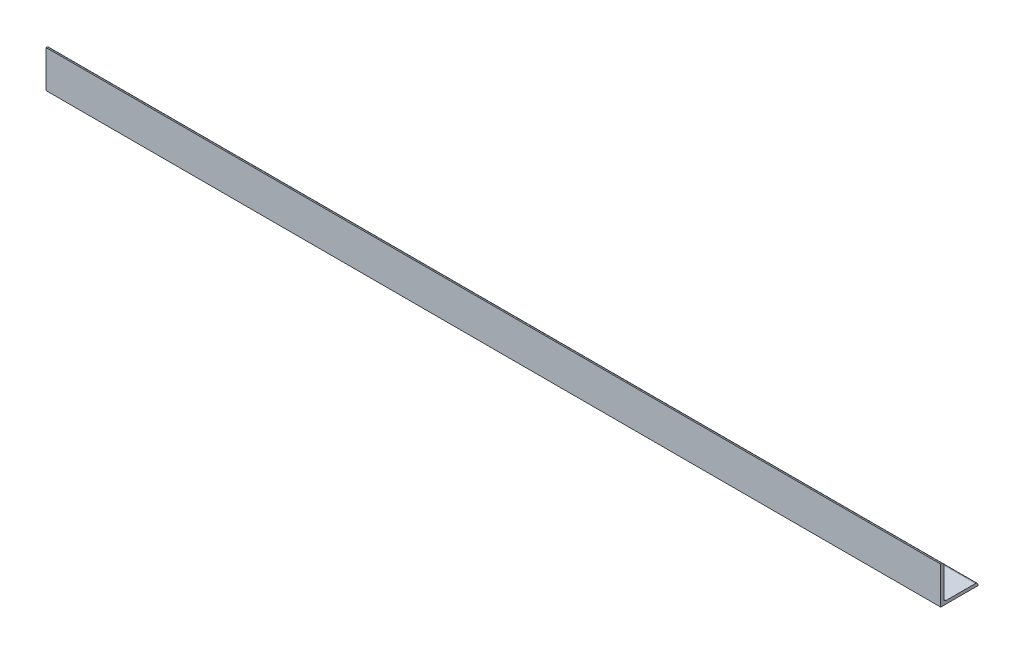
ISO-10303-21;
HEADER;
FILE_DESCRIPTION(('STEP AP214'),'2;1');
FILE_NAME('part.step','',(''),(''),'','','');
FILE_SCHEMA(('AUTOMOTIVE_DESIGN { 1 0 10303 214 1 1 1 1 }'));
ENDSEC;
DATA;
#1=APPLICATION_CONTEXT('core data for automotive mechanical design processes');
#2=APPLICATION_PROTOCOL_DEFINITION('international standard','automotive_design',2000,#1);
#3=PRODUCT_CONTEXT('',#1,'mechanical');
#4=PRODUCT('Part','Part','',(#3));
#5=PRODUCT_RELATED_PRODUCT_CATEGORY('part','',(#4));
#6=PRODUCT_DEFINITION_FORMATION('','',#4);
#7=PRODUCT_DEFINITION_CONTEXT('part definition',#1,'design');
#8=PRODUCT_DEFINITION('design','',#6,#7);
#9=PRODUCT_DEFINITION_SHAPE('','',#8);
#10=(LENGTH_UNIT() NAMED_UNIT(*) SI_UNIT(.MILLI.,.METRE.));
#11=(NAMED_UNIT(*) PLANE_ANGLE_UNIT() SI_UNIT($,.RADIAN.));
#12=(NAMED_UNIT(*) SI_UNIT($,.STERADIAN.) SOLID_ANGLE_UNIT());
#13=UNCERTAINTY_MEASURE_WITH_UNIT(LENGTH_MEASURE(1.E-05),#10,'distance_accuracy_value','');
#14=(GEOMETRIC_REPRESENTATION_CONTEXT(3) GLOBAL_UNCERTAINTY_ASSIGNED_CONTEXT((#13)) GLOBAL_UNIT_ASSIGNED_CONTEXT((#10,
#11,#12)) REPRESENTATION_CONTEXT('',''));
#15=CARTESIAN_POINT('',(0.,0.,0.));
#16=DIRECTION('',(0.,0.,1.));
#17=DIRECTION('',(1.,0.,0.));
#18=AXIS2_PLACEMENT_3D('',#15,#16,#17);
#19=CARTESIAN_POINT('',(-914.4,76.2,0.));
#20=DIRECTION('',(0.,1.,0.));
#21=DIRECTION('',(0.,0.,1.));
#22=AXIS2_PLACEMENT_3D('',#19,#20,#21);
#23=PLANE('',#22);
#24=DIRECTION('',(1.,0.,0.));
#25=VECTOR('',#24,1.);
#26=CARTESIAN_POINT('',(-914.4,76.2,0.));
#27=LINE('',#26,#25);
#28=CARTESIAN_POINT('',(-914.4,76.2,0.));
#29=VERTEX_POINT('',#28);
#30=CARTESIAN_POINT('',(914.4,76.2,0.));
#31=VERTEX_POINT('',#30);
#32=EDGE_CURVE('E35',#29,#31,#27,.T.);
#33=ORIENTED_EDGE('',*,*,#32,.T.);
#34=DIRECTION('',(0.,0.,1.));
#35=VECTOR('',#34,1.);
#36=CARTESIAN_POINT('',(914.4,76.2,0.));
#37=LINE('',#36,#35);
#38=CARTESIAN_POINT('',(914.4,76.2,-1.26999999999996));
#39=VERTEX_POINT('',#38);
#40=EDGE_CURVE('E102',#39,#31,#37,.T.);
#41=ORIENTED_EDGE('',*,*,#40,.F.);
#42=DIRECTION('',(1.,0.,0.));
#43=VECTOR('',#42,1.);
#44=CARTESIAN_POINT('',(-914.4,76.2,-1.26999999999996));
#45=LINE('',#44,#43);
#46=CARTESIAN_POINT('',(-914.4,76.2,-1.26999999999996));
#47=VERTEX_POINT('',#46);
#48=EDGE_CURVE('E11',#47,#39,#45,.T.);
#49=ORIENTED_EDGE('',*,*,#48,.F.);
#50=DIRECTION('',(0.,0.,1.));
#51=VECTOR('',#50,1.);
#52=CARTESIAN_POINT('',(-914.4,76.2,0.));
#53=LINE('',#52,#51);
#54=EDGE_CURVE('E103',#47,#29,#53,.T.);
#55=ORIENTED_EDGE('',*,*,#54,.T.);
#56=EDGE_LOOP('',(#33,#41,#49,#55));
#57=FACE_BOUND('',#56,.T.);
#58=ADVANCED_FACE('F32',(#57),#23,.T.);
#59=CARTESIAN_POINT('',(-914.4,71.12,-1.27));
#60=DIRECTION('',(1.,0.,0.));
#61=DIRECTION('',(0.,0.,-1.));
#62=AXIS2_PLACEMENT_3D('',#59,#60,#61);
#63=CYLINDRICAL_SURFACE('',#62,5.08);
#64=ORIENTED_EDGE('',*,*,#48,.T.);
#65=CARTESIAN_POINT('',(914.4,71.12,-1.27));
#66=DIRECTION('',(1.,0.,0.));
#67=DIRECTION('',(0.,0.,-1.));
#68=AXIS2_PLACEMENT_3D('',#65,#66,#67);
#69=CIRCLE('',#68,5.08);
#70=CARTESIAN_POINT('',(914.4,71.12,-6.35));
#71=VERTEX_POINT('',#70);
#72=EDGE_CURVE('E120',#71,#39,#69,.T.);
#73=ORIENTED_EDGE('',*,*,#72,.F.);
#74=DIRECTION('',(1.,0.,0.));
#75=VECTOR('',#74,1.);
#76=CARTESIAN_POINT('',(-914.4,71.12,-6.35));
#77=LINE('',#76,#75);
#78=CARTESIAN_POINT('',(-914.4,71.12,-6.35));
#79=VERTEX_POINT('',#78);
#80=EDGE_CURVE('E40',#79,#71,#77,.T.);
#81=ORIENTED_EDGE('',*,*,#80,.F.);
#82=CARTESIAN_POINT('',(-914.4,71.12,-1.27));
#83=DIRECTION('',(1.,0.,0.));
#84=DIRECTION('',(0.,0.,-1.));
#85=AXIS2_PLACEMENT_3D('',#82,#83,#84);
#86=CIRCLE('',#85,5.08);
#87=EDGE_CURVE('E108',#79,#47,#86,.T.);
#88=ORIENTED_EDGE('',*,*,#87,.T.);
#89=EDGE_LOOP('',(#64,#73,#81,#88));
#90=FACE_BOUND('',#89,.T.);
#91=ADVANCED_FACE('F196',(#90),#63,.T.);
#92=CARTESIAN_POINT('',(-914.4,71.12,-6.35));
#93=DIRECTION('',(0.,0.,-1.));
#94=DIRECTION('',(-1.,0.,0.));
#95=AXIS2_PLACEMENT_3D('',#92,#93,#94);
#96=PLANE('',#95);
#97=ORIENTED_EDGE('',*,*,#80,.T.);
#98=DIRECTION('',(0.,1.,0.));
#99=VECTOR('',#98,1.);
#100=CARTESIAN_POINT('',(914.4,71.12,-6.35));
#101=LINE('',#100,#99);
#102=CARTESIAN_POINT('',(914.4,11.43,-6.35));
#103=VERTEX_POINT('',#102);
#104=EDGE_CURVE('E136',#103,#71,#101,.T.);
#105=ORIENTED_EDGE('',*,*,#104,.F.);
#106=DIRECTION('',(1.,0.,0.));
#107=VECTOR('',#106,1.);
#108=CARTESIAN_POINT('',(-914.4,11.43,-6.35));
#109=LINE('',#108,#107);
#110=CARTESIAN_POINT('',(-914.4,11.43,-6.35));
#111=VERTEX_POINT('',#110);
#112=EDGE_CURVE('E161',#111,#103,#109,.T.);
#113=ORIENTED_EDGE('',*,*,#112,.F.);
#114=DIRECTION('',(0.,1.,0.));
#115=VECTOR('',#114,1.);
#116=CARTESIAN_POINT('',(-914.4,71.12,-6.35));
#117=LINE('',#116,#115);
#118=EDGE_CURVE('E157',#111,#79,#117,.T.);
#119=ORIENTED_EDGE('',*,*,#118,.T.);
#120=EDGE_LOOP('',(#97,#105,#113,#119));
#121=FACE_BOUND('',#120,.T.);
#122=ADVANCED_FACE('F194',(#121),#96,.T.);
#123=CARTESIAN_POINT('',(-914.4,11.43,-11.43));
#124=DIRECTION('',(1.,0.,0.));
#125=DIRECTION('',(0.,0.,-1.));
#126=AXIS2_PLACEMENT_3D('',#123,#124,#125);
#127=CYLINDRICAL_SURFACE('',#126,5.08);
#128=ORIENTED_EDGE('',*,*,#112,.T.);
#129=CARTESIAN_POINT('',(914.4,11.43,-11.43));
#130=DIRECTION('',(-1.,0.,0.));
#131=DIRECTION('',(0.,0.,-1.));
#132=AXIS2_PLACEMENT_3D('',#129,#130,#131);
#133=CIRCLE('',#132,5.08);
#134=CARTESIAN_POINT('',(914.4,6.35,-11.43));
#135=VERTEX_POINT('',#134);
#136=EDGE_CURVE('E133',#135,#103,#133,.T.);
#137=ORIENTED_EDGE('',*,*,#136,.F.);
#138=DIRECTION('',(1.,0.,0.));
#139=VECTOR('',#138,1.);
#140=CARTESIAN_POINT('',(-914.4,6.35,-11.43));
#141=LINE('',#140,#139);
#142=CARTESIAN_POINT('',(-914.4,6.35,-11.43));
#143=VERTEX_POINT('',#142);
#144=EDGE_CURVE('E163',#143,#135,#141,.T.);
#145=ORIENTED_EDGE('',*,*,#144,.F.);
#146=CARTESIAN_POINT('',(-914.4,11.43,-11.43));
#147=DIRECTION('',(-1.,0.,0.));
#148=DIRECTION('',(0.,0.,-1.));
#149=AXIS2_PLACEMENT_3D('',#146,#147,#148);
#150=CIRCLE('',#149,5.08);
#151=EDGE_CURVE('E154',#143,#111,#150,.T.);
#152=ORIENTED_EDGE('',*,*,#151,.T.);
#153=EDGE_LOOP('',(#128,#137,#145,#152));
#154=FACE_BOUND('',#153,.T.);
#155=ADVANCED_FACE('F192',(#154),#127,.F.);
#156=CARTESIAN_POINT('',(-914.4,6.35,-11.43));
#157=DIRECTION('',(0.,1.,0.));
#158=DIRECTION('',(0.,0.,1.));
#159=AXIS2_PLACEMENT_3D('',#156,#157,#158);
#160=PLANE('',#159);
#161=ORIENTED_EDGE('',*,*,#144,.T.);
#162=DIRECTION('',(0.,0.,1.));
#163=VECTOR('',#162,1.);
#164=CARTESIAN_POINT('',(914.4,6.35,-11.43));
#165=LINE('',#164,#163);
#166=CARTESIAN_POINT('',(914.4,6.35,-71.12));
#167=VERTEX_POINT('',#166);
#168=EDGE_CURVE('E130',#167,#135,#165,.T.);
#169=ORIENTED_EDGE('',*,*,#168,.F.);
#170=DIRECTION('',(1.,0.,0.));
#171=VECTOR('',#170,1.);
#172=CARTESIAN_POINT('',(-914.4,6.35,-71.12));
#173=LINE('',#172,#171);
#174=CARTESIAN_POINT('',(-914.4,6.35,-71.12));
#175=VERTEX_POINT('',#174);
#176=EDGE_CURVE('E165',#175,#167,#173,.T.);
#177=ORIENTED_EDGE('',*,*,#176,.F.);
#178=DIRECTION('',(0.,0.,1.));
#179=VECTOR('',#178,1.);
#180=CARTESIAN_POINT('',(-914.4,6.35,-11.43));
#181=LINE('',#180,#179);
#182=EDGE_CURVE('E151',#175,#143,#181,.T.);
#183=ORIENTED_EDGE('',*,*,#182,.T.);
#184=EDGE_LOOP('',(#161,#169,#177,#183));
#185=FACE_BOUND('',#184,.T.);
#186=ADVANCED_FACE('F187',(#185),#160,.T.);
#187=CARTESIAN_POINT('',(-914.4,1.27,-71.12));
#188=DIRECTION('',(1.,0.,0.));
#189=DIRECTION('',(0.,0.,-1.));
#190=AXIS2_PLACEMENT_3D('',#187,#188,#189);
#191=CYLINDRICAL_SURFACE('',#190,5.08);
#192=ORIENTED_EDGE('',*,*,#176,.T.);
#193=CARTESIAN_POINT('',(914.4,1.27,-71.12));
#194=DIRECTION('',(1.,0.,0.));
#195=DIRECTION('',(0.,0.,1.));
#196=AXIS2_PLACEMENT_3D('',#193,#194,#195);
#197=CIRCLE('',#196,5.08);
#198=CARTESIAN_POINT('',(914.4,1.26999999999996,-76.2));
#199=VERTEX_POINT('',#198);
#200=EDGE_CURVE('E127',#199,#167,#197,.T.);
#201=ORIENTED_EDGE('',*,*,#200,.F.);
#202=DIRECTION('',(1.,0.,0.));
#203=VECTOR('',#202,1.);
#204=CARTESIAN_POINT('',(-914.4,1.26999999999996,-76.2));
#205=LINE('',#204,#203);
#206=CARTESIAN_POINT('',(-914.4,1.26999999999996,-76.2));
#207=VERTEX_POINT('',#206);
#208=EDGE_CURVE('E167',#207,#199,#205,.T.);
#209=ORIENTED_EDGE('',*,*,#208,.F.);
#210=CARTESIAN_POINT('',(-914.4,1.27,-71.12));
#211=DIRECTION('',(1.,0.,0.));
#212=DIRECTION('',(0.,0.,1.));
#213=AXIS2_PLACEMENT_3D('',#210,#211,#212);
#214=CIRCLE('',#213,5.08);
#215=EDGE_CURVE('E148',#207,#175,#214,.T.);
#216=ORIENTED_EDGE('',*,*,#215,.T.);
#217=EDGE_LOOP('',(#192,#201,#209,#216));
#218=FACE_BOUND('',#217,.T.);
#219=ADVANCED_FACE('F180',(#218),#191,.T.);
#220=CARTESIAN_POINT('',(-914.4,1.26999999999996,-76.2));
#221=DIRECTION('',(0.,0.,-1.));
#222=DIRECTION('',(-1.,0.,0.));
#223=AXIS2_PLACEMENT_3D('',#220,#221,#222);
#224=PLANE('',#223);
#225=ORIENTED_EDGE('',*,*,#208,.T.);
#226=DIRECTION('',(0.,1.,0.));
#227=VECTOR('',#226,1.);
#228=CARTESIAN_POINT('',(914.4,1.26999999999996,-76.2));
#229=LINE('',#228,#227);
#230=CARTESIAN_POINT('',(914.4,0.,-76.2));
#231=VERTEX_POINT('',#230);
#232=EDGE_CURVE('E124',#231,#199,#229,.T.);
#233=ORIENTED_EDGE('',*,*,#232,.F.);
#234=DIRECTION('',(1.,0.,0.));
#235=VECTOR('',#234,1.);
#236=CARTESIAN_POINT('',(-914.4,0.,-76.2));
#237=LINE('',#236,#235);
#238=CARTESIAN_POINT('',(-914.4,0.,-76.2));
#239=VERTEX_POINT('',#238);
#240=EDGE_CURVE('E169',#239,#231,#237,.T.);
#241=ORIENTED_EDGE('',*,*,#240,.F.);
#242=DIRECTION('',(0.,1.,0.));
#243=VECTOR('',#242,1.);
#244=CARTESIAN_POINT('',(-914.4,1.26999999999996,-76.2));
#245=LINE('',#244,#243);
#246=EDGE_CURVE('E145',#239,#207,#245,.T.);
#247=ORIENTED_EDGE('',*,*,#246,.T.);
#248=EDGE_LOOP('',(#225,#233,#241,#247));
#249=FACE_BOUND('',#248,.T.);
#250=ADVANCED_FACE('F177',(#249),#224,.T.);
#251=CARTESIAN_POINT('',(-914.4,0.,0.));
#252=DIRECTION('',(0.,-1.,0.));
#253=DIRECTION('',(0.,0.,-1.));
#254=AXIS2_PLACEMENT_3D('',#251,#252,#253);
#255=PLANE('',#254);
#256=ORIENTED_EDGE('',*,*,#240,.T.);
#257=DIRECTION('',(0.,0.,-1.));
#258=VECTOR('',#257,1.);
#259=CARTESIAN_POINT('',(914.4,0.,0.));
#260=LINE('',#259,#258);
#261=CARTESIAN_POINT('',(914.4,0.,0.));
#262=VERTEX_POINT('',#261);
#263=EDGE_CURVE('E115',#262,#231,#260,.T.);
#264=ORIENTED_EDGE('',*,*,#263,.F.);
#265=DIRECTION('',(1.,0.,0.));
#266=VECTOR('',#265,1.);
#267=CARTESIAN_POINT('',(-914.4,0.,0.));
#268=LINE('',#267,#266);
#269=CARTESIAN_POINT('',(-914.4,0.,0.));
#270=VERTEX_POINT('',#269);
#271=EDGE_CURVE('E107',#270,#262,#268,.T.);
#272=ORIENTED_EDGE('',*,*,#271,.F.);
#273=DIRECTION('',(0.,0.,-1.));
#274=VECTOR('',#273,1.);
#275=CARTESIAN_POINT('',(-914.4,0.,0.));
#276=LINE('',#275,#274);
#277=EDGE_CURVE('E142',#270,#239,#276,.T.);
#278=ORIENTED_EDGE('',*,*,#277,.T.);
#279=EDGE_LOOP('',(#256,#264,#272,#278));
#280=FACE_BOUND('',#279,.T.);
#281=ADVANCED_FACE('F171',(#280),#255,.T.);
#282=CARTESIAN_POINT('',(-914.4,76.2,0.));
#283=DIRECTION('',(0.,0.,1.));
#284=DIRECTION('',(1.,0.,0.));
#285=AXIS2_PLACEMENT_3D('',#282,#283,#284);
#286=PLANE('',#285);
#287=ORIENTED_EDGE('',*,*,#271,.T.);
#288=DIRECTION('',(0.,-1.,0.));
#289=VECTOR('',#288,1.);
#290=CARTESIAN_POINT('',(914.4,76.2,0.));
#291=LINE('',#290,#289);
#292=EDGE_CURVE('E110',#31,#262,#291,.T.);
#293=ORIENTED_EDGE('',*,*,#292,.F.);
#294=ORIENTED_EDGE('',*,*,#32,.F.);
#295=DIRECTION('',(0.,-1.,0.));
#296=VECTOR('',#295,1.);
#297=CARTESIAN_POINT('',(-914.4,76.2,0.));
#298=LINE('',#297,#296);
#299=EDGE_CURVE('E140',#29,#270,#298,.T.);
#300=ORIENTED_EDGE('',*,*,#299,.T.);
#301=EDGE_LOOP('',(#287,#293,#294,#300));
#302=FACE_BOUND('',#301,.T.);
#303=ADVANCED_FACE('F111',(#302),#286,.T.);
#304=CARTESIAN_POINT('',(-914.4,71.12,-1.27));
#305=DIRECTION('',(1.,0.,0.));
#306=DIRECTION('',(0.,0.,-1.));
#307=AXIS2_PLACEMENT_3D('',#304,#305,#306);
#308=PLANE('',#307);
#309=ORIENTED_EDGE('',*,*,#54,.F.);
#310=ORIENTED_EDGE('',*,*,#87,.F.);
#311=ORIENTED_EDGE('',*,*,#118,.F.);
#312=ORIENTED_EDGE('',*,*,#151,.F.);
#313=ORIENTED_EDGE('',*,*,#182,.F.);
#314=ORIENTED_EDGE('',*,*,#215,.F.);
#315=ORIENTED_EDGE('',*,*,#246,.F.);
#316=ORIENTED_EDGE('',*,*,#277,.F.);
#317=ORIENTED_EDGE('',*,*,#299,.F.);
#318=EDGE_LOOP('',(#309,#310,#311,#312,#313,#314,#315,#316,#317));
#319=FACE_BOUND('',#318,.T.);
#320=ADVANCED_FACE('F183',(#319),#308,.F.);
#321=CARTESIAN_POINT('',(914.4,71.12,-1.27));
#322=DIRECTION('',(1.,0.,0.));
#323=DIRECTION('',(0.,0.,-1.));
#324=AXIS2_PLACEMENT_3D('',#321,#322,#323);
#325=PLANE('',#324);
#326=ORIENTED_EDGE('',*,*,#40,.T.);
#327=ORIENTED_EDGE('',*,*,#292,.T.);
#328=ORIENTED_EDGE('',*,*,#263,.T.);
#329=ORIENTED_EDGE('',*,*,#232,.T.);
#330=ORIENTED_EDGE('',*,*,#200,.T.);
#331=ORIENTED_EDGE('',*,*,#168,.T.);
#332=ORIENTED_EDGE('',*,*,#136,.T.);
#333=ORIENTED_EDGE('',*,*,#104,.T.);
#334=ORIENTED_EDGE('',*,*,#72,.T.);
#335=EDGE_LOOP('',(#326,#327,#328,#329,#330,#331,#332,#333,#334));
#336=FACE_BOUND('',#335,.T.);
#337=ADVANCED_FACE('F118',(#336),#325,.T.);
#338=CLOSED_SHELL('',(#58,#91,#122,#155,#186,#219,#250,#281,#303,#320,#337));
#339=MANIFOLD_SOLID_BREP('B2',#338);
#340=ADVANCED_BREP_SHAPE_REPRESENTATION('',(#18,#339),#14);
#341=SHAPE_DEFINITION_REPRESENTATION(#9,#340);
ENDSEC;
END-ISO-10303-21;
